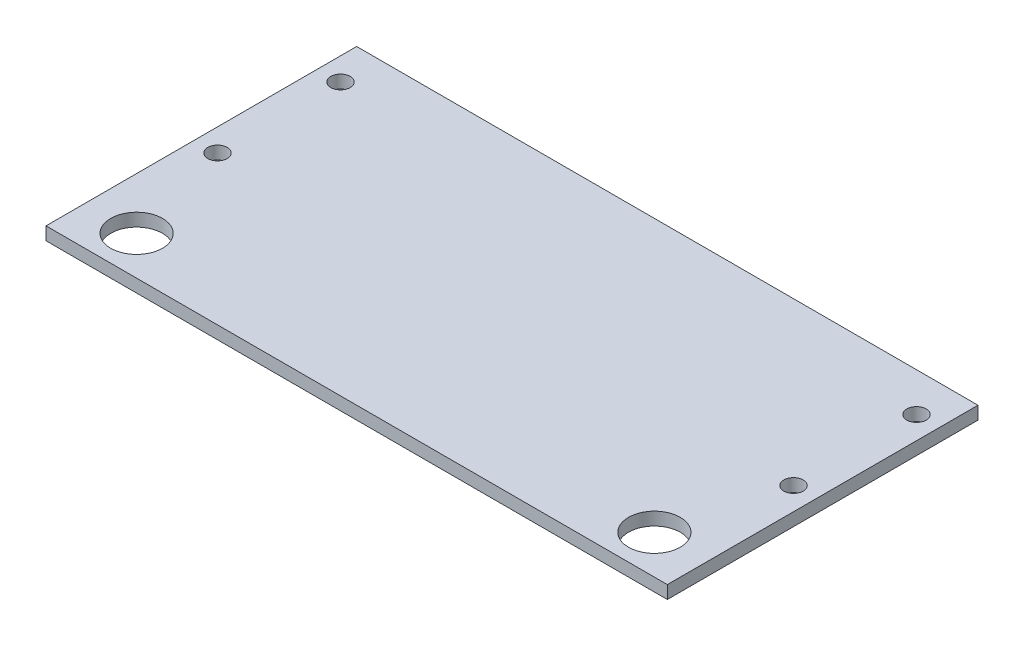
ISO-10303-21;
HEADER;
FILE_DESCRIPTION(('STEP AP214'),'2;1');
FILE_NAME('part.step','',(''),(''),'','','');
FILE_SCHEMA(('AUTOMOTIVE_DESIGN { 1 0 10303 214 1 1 1 1 }'));
ENDSEC;
DATA;
#1=APPLICATION_CONTEXT('core data for automotive mechanical design processes');
#2=APPLICATION_PROTOCOL_DEFINITION('international standard','automotive_design',2000,#1);
#3=PRODUCT_CONTEXT('',#1,'mechanical');
#4=PRODUCT('Part','Part','',(#3));
#5=PRODUCT_RELATED_PRODUCT_CATEGORY('part','',(#4));
#6=PRODUCT_DEFINITION_FORMATION('','',#4);
#7=PRODUCT_DEFINITION_CONTEXT('part definition',#1,'design');
#8=PRODUCT_DEFINITION('design','',#6,#7);
#9=PRODUCT_DEFINITION_SHAPE('','',#8);
#10=(LENGTH_UNIT() NAMED_UNIT(*) SI_UNIT(.MILLI.,.METRE.));
#11=(NAMED_UNIT(*) PLANE_ANGLE_UNIT() SI_UNIT($,.RADIAN.));
#12=(NAMED_UNIT(*) SI_UNIT($,.STERADIAN.) SOLID_ANGLE_UNIT());
#13=UNCERTAINTY_MEASURE_WITH_UNIT(LENGTH_MEASURE(1.E-05),#10,'distance_accuracy_value','');
#14=(GEOMETRIC_REPRESENTATION_CONTEXT(3) GLOBAL_UNCERTAINTY_ASSIGNED_CONTEXT((#13)) GLOBAL_UNIT_ASSIGNED_CONTEXT((#10,
#11,#12)) REPRESENTATION_CONTEXT('',''));
#15=CARTESIAN_POINT('',(0.,0.,0.));
#16=DIRECTION('',(0.,0.,1.));
#17=DIRECTION('',(1.,0.,0.));
#18=AXIS2_PLACEMENT_3D('',#15,#16,#17);
#19=CARTESIAN_POINT('',(0.,6.35,0.));
#20=DIRECTION('',(1.,0.,0.));
#21=DIRECTION('',(0.,0.,-1.));
#22=AXIS2_PLACEMENT_3D('',#19,#20,#21);
#23=PLANE('',#22);
#24=DIRECTION('',(0.,0.,1.));
#25=VECTOR('',#24,1.);
#26=CARTESIAN_POINT('',(0.,0.,0.));
#27=LINE('',#26,#25);
#28=CARTESIAN_POINT('',(0.,0.,-152.4));
#29=VERTEX_POINT('',#28);
#30=CARTESIAN_POINT('',(0.,0.,0.));
#31=VERTEX_POINT('',#30);
#32=EDGE_CURVE('E80',#29,#31,#27,.T.);
#33=ORIENTED_EDGE('',*,*,#32,.T.);
#34=DIRECTION('',(0.,-1.,0.));
#35=VECTOR('',#34,1.);
#36=CARTESIAN_POINT('',(0.,6.35,0.));
#37=LINE('',#36,#35);
#38=CARTESIAN_POINT('',(0.,6.35,0.));
#39=VERTEX_POINT('',#38);
#40=EDGE_CURVE('E11',#39,#31,#37,.T.);
#41=ORIENTED_EDGE('',*,*,#40,.F.);
#42=DIRECTION('',(0.,0.,1.));
#43=VECTOR('',#42,1.);
#44=CARTESIAN_POINT('',(0.,6.35,0.));
#45=LINE('',#44,#43);
#46=CARTESIAN_POINT('',(0.,6.35,-152.4));
#47=VERTEX_POINT('',#46);
#48=EDGE_CURVE('E68',#47,#39,#45,.T.);
#49=ORIENTED_EDGE('',*,*,#48,.F.);
#50=DIRECTION('',(0.,-1.,0.));
#51=VECTOR('',#50,1.);
#52=CARTESIAN_POINT('',(0.,6.35,-152.4));
#53=LINE('',#52,#51);
#54=EDGE_CURVE('E76',#47,#29,#53,.T.);
#55=ORIENTED_EDGE('',*,*,#54,.T.);
#56=EDGE_LOOP('',(#33,#41,#49,#55));
#57=FACE_BOUND('',#56,.T.);
#58=ADVANCED_FACE('F17',(#57),#23,.F.);
#59=CARTESIAN_POINT('',(0.,6.35,0.));
#60=DIRECTION('',(0.,0.,-1.));
#61=DIRECTION('',(-1.,0.,0.));
#62=AXIS2_PLACEMENT_3D('',#59,#60,#61);
#63=PLANE('',#62);
#64=DIRECTION('',(1.,0.,0.));
#65=VECTOR('',#64,1.);
#66=CARTESIAN_POINT('',(0.,0.,0.));
#67=LINE('',#66,#65);
#68=CARTESIAN_POINT('',(304.8,0.,0.));
#69=VERTEX_POINT('',#68);
#70=EDGE_CURVE('E72',#31,#69,#67,.T.);
#71=ORIENTED_EDGE('',*,*,#70,.T.);
#72=DIRECTION('',(0.,-1.,0.));
#73=VECTOR('',#72,1.);
#74=CARTESIAN_POINT('',(304.8,6.35,0.));
#75=LINE('',#74,#73);
#76=CARTESIAN_POINT('',(304.8,6.35,0.));
#77=VERTEX_POINT('',#76);
#78=EDGE_CURVE('E25',#77,#69,#75,.T.);
#79=ORIENTED_EDGE('',*,*,#78,.F.);
#80=DIRECTION('',(1.,0.,0.));
#81=VECTOR('',#80,1.);
#82=CARTESIAN_POINT('',(0.,6.35,0.));
#83=LINE('',#82,#81);
#84=EDGE_CURVE('E63',#39,#77,#83,.T.);
#85=ORIENTED_EDGE('',*,*,#84,.F.);
#86=ORIENTED_EDGE('',*,*,#40,.T.);
#87=EDGE_LOOP('',(#71,#79,#85,#86));
#88=FACE_BOUND('',#87,.T.);
#89=ADVANCED_FACE('F71',(#88),#63,.F.);
#90=CARTESIAN_POINT('',(304.8,6.35,0.));
#91=DIRECTION('',(-1.,0.,0.));
#92=DIRECTION('',(0.,0.,1.));
#93=AXIS2_PLACEMENT_3D('',#90,#91,#92);
#94=PLANE('',#93);
#95=DIRECTION('',(0.,0.,-1.));
#96=VECTOR('',#95,1.);
#97=CARTESIAN_POINT('',(304.8,0.,0.));
#98=LINE('',#97,#96);
#99=CARTESIAN_POINT('',(304.8,0.,-152.4));
#100=VERTEX_POINT('',#99);
#101=EDGE_CURVE('E50',#69,#100,#98,.T.);
#102=ORIENTED_EDGE('',*,*,#101,.T.);
#103=DIRECTION('',(0.,-1.,0.));
#104=VECTOR('',#103,1.);
#105=CARTESIAN_POINT('',(304.8,6.35,-152.4));
#106=LINE('',#105,#104);
#107=CARTESIAN_POINT('',(304.8,6.35,-152.4));
#108=VERTEX_POINT('',#107);
#109=EDGE_CURVE('E73',#108,#100,#106,.T.);
#110=ORIENTED_EDGE('',*,*,#109,.F.);
#111=DIRECTION('',(0.,0.,-1.));
#112=VECTOR('',#111,1.);
#113=CARTESIAN_POINT('',(304.8,6.35,0.));
#114=LINE('',#113,#112);
#115=EDGE_CURVE('E66',#77,#108,#114,.T.);
#116=ORIENTED_EDGE('',*,*,#115,.F.);
#117=ORIENTED_EDGE('',*,*,#78,.T.);
#118=EDGE_LOOP('',(#102,#110,#116,#117));
#119=FACE_BOUND('',#118,.T.);
#120=ADVANCED_FACE('F74',(#119),#94,.F.);
#121=CARTESIAN_POINT('',(0.,6.35,-152.4));
#122=DIRECTION('',(0.,0.,1.));
#123=DIRECTION('',(1.,0.,0.));
#124=AXIS2_PLACEMENT_3D('',#121,#122,#123);
#125=PLANE('',#124);
#126=DIRECTION('',(-1.,0.,0.));
#127=VECTOR('',#126,1.);
#128=CARTESIAN_POINT('',(0.,0.,-152.4));
#129=LINE('',#128,#127);
#130=EDGE_CURVE('E56',#100,#29,#129,.T.);
#131=ORIENTED_EDGE('',*,*,#130,.T.);
#132=ORIENTED_EDGE('',*,*,#54,.F.);
#133=DIRECTION('',(-1.,0.,0.));
#134=VECTOR('',#133,1.);
#135=CARTESIAN_POINT('',(0.,6.35,-152.4));
#136=LINE('',#135,#134);
#137=EDGE_CURVE('E33',#108,#47,#136,.T.);
#138=ORIENTED_EDGE('',*,*,#137,.F.);
#139=ORIENTED_EDGE('',*,*,#109,.T.);
#140=EDGE_LOOP('',(#131,#132,#138,#139));
#141=FACE_BOUND('',#140,.T.);
#142=ADVANCED_FACE('F88',(#141),#125,.F.);
#143=CARTESIAN_POINT('',(0.,6.35,-152.4));
#144=DIRECTION('',(0.,-1.,0.));
#145=DIRECTION('',(0.,0.,-1.));
#146=AXIS2_PLACEMENT_3D('',#143,#144,#145);
#147=PLANE('',#146);
#148=CARTESIAN_POINT('',(279.4,6.35,-19.05));
#149=DIRECTION('',(0.,1.,0.));
#150=DIRECTION('',(0.,0.,-1.));
#151=AXIS2_PLACEMENT_3D('',#148,#149,#150);
#152=CIRCLE('',#151,12.7);
#153=CARTESIAN_POINT('',(279.4,6.35,-31.75));
#154=VERTEX_POINT('',#153);
#155=EDGE_CURVE('E121',#154,#154,#152,.T.);
#156=ORIENTED_EDGE('',*,*,#155,.F.);
#157=EDGE_LOOP('',(#156));
#158=FACE_BOUND('',#157,.T.);
#159=CARTESIAN_POINT('',(293.6875,6.35,-73.025));
#160=DIRECTION('',(0.,1.,0.));
#161=DIRECTION('',(0.,0.,-1.));
#162=AXIS2_PLACEMENT_3D('',#159,#160,#161);
#163=CIRCLE('',#162,4.7625);
#164=CARTESIAN_POINT('',(293.6875,6.35,-77.7875));
#165=VERTEX_POINT('',#164);
#166=EDGE_CURVE('E115',#165,#165,#163,.T.);
#167=ORIENTED_EDGE('',*,*,#166,.F.);
#168=EDGE_LOOP('',(#167));
#169=FACE_BOUND('',#168,.T.);
#170=CARTESIAN_POINT('',(293.6875,6.35,-133.35));
#171=DIRECTION('',(0.,1.,0.));
#172=DIRECTION('',(0.,0.,-1.));
#173=AXIS2_PLACEMENT_3D('',#170,#171,#172);
#174=CIRCLE('',#173,4.7625);
#175=CARTESIAN_POINT('',(293.6875,6.35,-138.1125));
#176=VERTEX_POINT('',#175);
#177=EDGE_CURVE('E109',#176,#176,#174,.T.);
#178=ORIENTED_EDGE('',*,*,#177,.F.);
#179=EDGE_LOOP('',(#178));
#180=FACE_BOUND('',#179,.T.);
#181=CARTESIAN_POINT('',(11.1125,6.35,-73.025));
#182=DIRECTION('',(0.,1.,0.));
#183=DIRECTION('',(0.,0.,1.));
#184=AXIS2_PLACEMENT_3D('',#181,#182,#183);
#185=CIRCLE('',#184,4.7625);
#186=CARTESIAN_POINT('',(11.1125,6.35,-68.2625));
#187=VERTEX_POINT('',#186);
#188=EDGE_CURVE('E103',#187,#187,#185,.T.);
#189=ORIENTED_EDGE('',*,*,#188,.F.);
#190=EDGE_LOOP('',(#189));
#191=FACE_BOUND('',#190,.T.);
#192=CARTESIAN_POINT('',(11.1125,6.35,-133.35));
#193=DIRECTION('',(0.,1.,0.));
#194=DIRECTION('',(0.,0.,1.));
#195=AXIS2_PLACEMENT_3D('',#192,#193,#194);
#196=CIRCLE('',#195,4.7625);
#197=CARTESIAN_POINT('',(11.1125,6.35,-128.5875));
#198=VERTEX_POINT('',#197);
#199=EDGE_CURVE('E97',#198,#198,#196,.T.);
#200=ORIENTED_EDGE('',*,*,#199,.F.);
#201=EDGE_LOOP('',(#200));
#202=FACE_BOUND('',#201,.T.);
#203=CARTESIAN_POINT('',(25.4,6.35,-19.05));
#204=DIRECTION('',(0.,1.,0.));
#205=DIRECTION('',(0.,0.,1.));
#206=AXIS2_PLACEMENT_3D('',#203,#204,#205);
#207=CIRCLE('',#206,12.7);
#208=CARTESIAN_POINT('',(25.4,6.35,-6.35));
#209=VERTEX_POINT('',#208);
#210=EDGE_CURVE('E83',#209,#209,#207,.T.);
#211=ORIENTED_EDGE('',*,*,#210,.F.);
#212=EDGE_LOOP('',(#211));
#213=FACE_BOUND('',#212,.T.);
#214=ORIENTED_EDGE('',*,*,#48,.T.);
#215=ORIENTED_EDGE('',*,*,#84,.T.);
#216=ORIENTED_EDGE('',*,*,#115,.T.);
#217=ORIENTED_EDGE('',*,*,#137,.T.);
#218=EDGE_LOOP('',(#214,#215,#216,#217));
#219=FACE_BOUND('',#218,.T.);
#220=ADVANCED_FACE('F64',(#158,#169,#180,#191,#202,#213,#219),#147,.F.);
#221=CARTESIAN_POINT('',(0.,0.,-152.4));
#222=DIRECTION('',(0.,-1.,0.));
#223=DIRECTION('',(0.,0.,-1.));
#224=AXIS2_PLACEMENT_3D('',#221,#222,#223);
#225=PLANE('',#224);
#226=CARTESIAN_POINT('',(279.4,0.,-19.05));
#227=DIRECTION('',(0.,-1.,0.));
#228=DIRECTION('',(0.,0.,-1.));
#229=AXIS2_PLACEMENT_3D('',#226,#227,#228);
#230=CIRCLE('',#229,12.7);
#231=CARTESIAN_POINT('',(279.4,0.,-31.75));
#232=VERTEX_POINT('',#231);
#233=EDGE_CURVE('E124',#232,#232,#230,.F.);
#234=ORIENTED_EDGE('',*,*,#233,.T.);
#235=EDGE_LOOP('',(#234));
#236=FACE_BOUND('',#235,.T.);
#237=CARTESIAN_POINT('',(293.6875,0.,-73.025));
#238=DIRECTION('',(0.,-1.,0.));
#239=DIRECTION('',(0.,0.,-1.));
#240=AXIS2_PLACEMENT_3D('',#237,#238,#239);
#241=CIRCLE('',#240,4.7625);
#242=CARTESIAN_POINT('',(293.6875,0.,-77.7875));
#243=VERTEX_POINT('',#242);
#244=EDGE_CURVE('E118',#243,#243,#241,.F.);
#245=ORIENTED_EDGE('',*,*,#244,.T.);
#246=EDGE_LOOP('',(#245));
#247=FACE_BOUND('',#246,.T.);
#248=CARTESIAN_POINT('',(293.6875,0.,-133.35));
#249=DIRECTION('',(0.,-1.,0.));
#250=DIRECTION('',(0.,0.,-1.));
#251=AXIS2_PLACEMENT_3D('',#248,#249,#250);
#252=CIRCLE('',#251,4.7625);
#253=CARTESIAN_POINT('',(293.6875,0.,-138.1125));
#254=VERTEX_POINT('',#253);
#255=EDGE_CURVE('E112',#254,#254,#252,.F.);
#256=ORIENTED_EDGE('',*,*,#255,.T.);
#257=EDGE_LOOP('',(#256));
#258=FACE_BOUND('',#257,.T.);
#259=CARTESIAN_POINT('',(11.1125,0.,-73.025));
#260=DIRECTION('',(0.,-1.,0.));
#261=DIRECTION('',(0.,0.,-1.));
#262=AXIS2_PLACEMENT_3D('',#259,#260,#261);
#263=CIRCLE('',#262,4.7625);
#264=CARTESIAN_POINT('',(11.1125,0.,-77.7875));
#265=VERTEX_POINT('',#264);
#266=EDGE_CURVE('E106',#265,#265,#263,.F.);
#267=ORIENTED_EDGE('',*,*,#266,.T.);
#268=EDGE_LOOP('',(#267));
#269=FACE_BOUND('',#268,.T.);
#270=CARTESIAN_POINT('',(11.1125,0.,-133.35));
#271=DIRECTION('',(0.,-1.,0.));
#272=DIRECTION('',(0.,0.,-1.));
#273=AXIS2_PLACEMENT_3D('',#270,#271,#272);
#274=CIRCLE('',#273,4.7625);
#275=CARTESIAN_POINT('',(11.1125,0.,-138.1125));
#276=VERTEX_POINT('',#275);
#277=EDGE_CURVE('E100',#276,#276,#274,.F.);
#278=ORIENTED_EDGE('',*,*,#277,.T.);
#279=EDGE_LOOP('',(#278));
#280=FACE_BOUND('',#279,.T.);
#281=CARTESIAN_POINT('',(25.4,0.,-19.05));
#282=DIRECTION('',(0.,-1.,0.));
#283=DIRECTION('',(0.,0.,-1.));
#284=AXIS2_PLACEMENT_3D('',#281,#282,#283);
#285=CIRCLE('',#284,12.7);
#286=CARTESIAN_POINT('',(25.4,0.,-31.75));
#287=VERTEX_POINT('',#286);
#288=EDGE_CURVE('E94',#287,#287,#285,.F.);
#289=ORIENTED_EDGE('',*,*,#288,.T.);
#290=EDGE_LOOP('',(#289));
#291=FACE_BOUND('',#290,.T.);
#292=ORIENTED_EDGE('',*,*,#32,.F.);
#293=ORIENTED_EDGE('',*,*,#130,.F.);
#294=ORIENTED_EDGE('',*,*,#101,.F.);
#295=ORIENTED_EDGE('',*,*,#70,.F.);
#296=EDGE_LOOP('',(#292,#293,#294,#295));
#297=FACE_BOUND('',#296,.T.);
#298=ADVANCED_FACE('F91',(#236,#247,#258,#269,#280,#291,#297),#225,.T.);
#299=CARTESIAN_POINT('',(25.4,-0.00100000000000013,-19.05));
#300=DIRECTION('',(0.,1.,0.));
#301=DIRECTION('',(0.,0.,1.));
#302=AXIS2_PLACEMENT_3D('',#299,#300,#301);
#303=CYLINDRICAL_SURFACE('',#302,12.7);
#304=ORIENTED_EDGE('',*,*,#288,.F.);
#305=EDGE_LOOP('',(#304));
#306=FACE_BOUND('',#305,.T.);
#307=ORIENTED_EDGE('',*,*,#210,.T.);
#308=EDGE_LOOP('',(#307));
#309=FACE_BOUND('',#308,.T.);
#310=ADVANCED_FACE('F145',(#306,#309),#303,.F.);
#311=CARTESIAN_POINT('',(11.1125,-0.00100000000000013,-133.35));
#312=DIRECTION('',(0.,1.,0.));
#313=DIRECTION('',(0.,0.,1.));
#314=AXIS2_PLACEMENT_3D('',#311,#312,#313);
#315=CYLINDRICAL_SURFACE('',#314,4.7625);
#316=ORIENTED_EDGE('',*,*,#277,.F.);
#317=EDGE_LOOP('',(#316));
#318=FACE_BOUND('',#317,.T.);
#319=ORIENTED_EDGE('',*,*,#199,.T.);
#320=EDGE_LOOP('',(#319));
#321=FACE_BOUND('',#320,.T.);
#322=ADVANCED_FACE('F147',(#318,#321),#315,.F.);
#323=CARTESIAN_POINT('',(11.1125,-0.00100000000000013,-73.025));
#324=DIRECTION('',(0.,1.,0.));
#325=DIRECTION('',(0.,0.,1.));
#326=AXIS2_PLACEMENT_3D('',#323,#324,#325);
#327=CYLINDRICAL_SURFACE('',#326,4.7625);
#328=ORIENTED_EDGE('',*,*,#266,.F.);
#329=EDGE_LOOP('',(#328));
#330=FACE_BOUND('',#329,.T.);
#331=ORIENTED_EDGE('',*,*,#188,.T.);
#332=EDGE_LOOP('',(#331));
#333=FACE_BOUND('',#332,.T.);
#334=ADVANCED_FACE('F156',(#330,#333),#327,.F.);
#335=CARTESIAN_POINT('',(293.6875,-0.00100000000000013,-133.35));
#336=DIRECTION('',(0.,1.,0.));
#337=DIRECTION('',(0.,0.,1.));
#338=AXIS2_PLACEMENT_3D('',#335,#336,#337);
#339=CYLINDRICAL_SURFACE('',#338,4.7625);
#340=ORIENTED_EDGE('',*,*,#255,.F.);
#341=EDGE_LOOP('',(#340));
#342=FACE_BOUND('',#341,.T.);
#343=ORIENTED_EDGE('',*,*,#177,.T.);
#344=EDGE_LOOP('',(#343));
#345=FACE_BOUND('',#344,.T.);
#346=ADVANCED_FACE('F213',(#342,#345),#339,.F.);
#347=CARTESIAN_POINT('',(293.6875,-0.00100000000000013,-73.025));
#348=DIRECTION('',(0.,1.,0.));
#349=DIRECTION('',(0.,0.,1.));
#350=AXIS2_PLACEMENT_3D('',#347,#348,#349);
#351=CYLINDRICAL_SURFACE('',#350,4.7625);
#352=ORIENTED_EDGE('',*,*,#244,.F.);
#353=EDGE_LOOP('',(#352));
#354=FACE_BOUND('',#353,.T.);
#355=ORIENTED_EDGE('',*,*,#166,.T.);
#356=EDGE_LOOP('',(#355));
#357=FACE_BOUND('',#356,.T.);
#358=ADVANCED_FACE('F223',(#354,#357),#351,.F.);
#359=CARTESIAN_POINT('',(279.4,-0.00100000000000013,-19.05));
#360=DIRECTION('',(0.,1.,0.));
#361=DIRECTION('',(0.,0.,1.));
#362=AXIS2_PLACEMENT_3D('',#359,#360,#361);
#363=CYLINDRICAL_SURFACE('',#362,12.7);
#364=ORIENTED_EDGE('',*,*,#233,.F.);
#365=EDGE_LOOP('',(#364));
#366=FACE_BOUND('',#365,.T.);
#367=ORIENTED_EDGE('',*,*,#155,.T.);
#368=EDGE_LOOP('',(#367));
#369=FACE_BOUND('',#368,.T.);
#370=ADVANCED_FACE('F130',(#366,#369),#363,.F.);
#371=CLOSED_SHELL('',(#58,#89,#120,#142,#220,#298,#310,#322,#334,#346,#358,#370));
#372=MANIFOLD_SOLID_BREP('B1',#371);
#373=ADVANCED_BREP_SHAPE_REPRESENTATION('',(#18,#372),#14);
#374=SHAPE_DEFINITION_REPRESENTATION(#9,#373);
ENDSEC;
END-ISO-10303-21;
